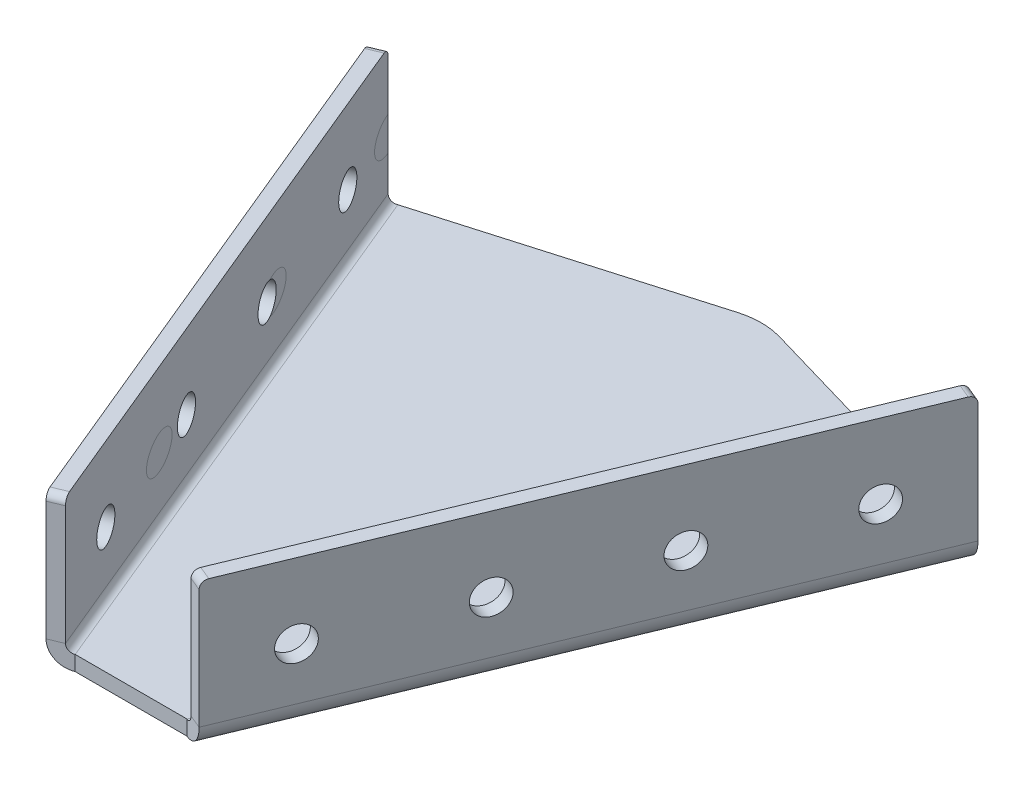
ISO-10303-21;
HEADER;
FILE_DESCRIPTION(('STEP AP214'),'2;1');
FILE_NAME('part.step','',(''),(''),'','','');
FILE_SCHEMA(('AUTOMOTIVE_DESIGN { 1 0 10303 214 1 1 1 1 }'));
ENDSEC;
DATA;
#1=APPLICATION_CONTEXT('core data for automotive mechanical design processes');
#2=APPLICATION_PROTOCOL_DEFINITION('international standard','automotive_design',2000,#1);
#3=PRODUCT_CONTEXT('',#1,'mechanical');
#4=PRODUCT('Part','Part','',(#3));
#5=PRODUCT_RELATED_PRODUCT_CATEGORY('part','',(#4));
#6=PRODUCT_DEFINITION_FORMATION('','',#4);
#7=PRODUCT_DEFINITION_CONTEXT('part definition',#1,'design');
#8=PRODUCT_DEFINITION('design','',#6,#7);
#9=PRODUCT_DEFINITION_SHAPE('','',#8);
#10=(LENGTH_UNIT() NAMED_UNIT(*) SI_UNIT(.MILLI.,.METRE.));
#11=(NAMED_UNIT(*) PLANE_ANGLE_UNIT() SI_UNIT($,.RADIAN.));
#12=(NAMED_UNIT(*) SI_UNIT($,.STERADIAN.) SOLID_ANGLE_UNIT());
#13=UNCERTAINTY_MEASURE_WITH_UNIT(LENGTH_MEASURE(1.E-05),#10,'distance_accuracy_value','');
#14=(GEOMETRIC_REPRESENTATION_CONTEXT(3) GLOBAL_UNCERTAINTY_ASSIGNED_CONTEXT((#13)) GLOBAL_UNIT_ASSIGNED_CONTEXT((#10,
#11,#12)) REPRESENTATION_CONTEXT('',''));
#15=CARTESIAN_POINT('',(0.,0.,0.));
#16=DIRECTION('',(0.,0.,1.));
#17=DIRECTION('',(1.,0.,0.));
#18=AXIS2_PLACEMENT_3D('',#15,#16,#17);
#19=CARTESIAN_POINT('',(-14.6510599239217,0.,6.06866772362923));
#20=DIRECTION('',(0.923879532511288,0.,-0.382683432365087));
#21=DIRECTION('',(-0.382683432365087,0.,-0.923879532511288));
#22=AXIS2_PLACEMENT_3D('',#19,#20,#21);
#23=PLANE('',#22);
#24=CARTESIAN_POINT('',(-34.6502513682729,32.9999999999987,-42.2136514978195));
#25=DIRECTION('',(0.923879532511288,0.,-0.382683432365087));
#26=DIRECTION('',(0.382683432365087,0.,0.923879532511288));
#27=AXIS2_PLACEMENT_3D('',#24,#25,#26);
#28=ELLIPSE('',#27,6.36396103067892,4.50000000000002);
#29=CARTESIAN_POINT('',(-32.214868917615,32.9999999999986,-36.3341181558758));
#30=VERTEX_POINT('',#29);
#31=EDGE_CURVE('E305',#30,#30,#28,.F.);
#32=ORIENTED_EDGE('',*,*,#31,.F.);
#33=EDGE_LOOP('',(#32));
#34=FACE_BOUND('',#33,.T.);
#35=ADVANCED_FACE('F16',(#34),#23,.T.);
#36=CARTESIAN_POINT('',(-56.2980953741205,32.9999999999988,-94.4761700928743));
#37=DIRECTION('',(0.923879532511288,0.,-0.382683432365087));
#38=DIRECTION('',(0.382683432365087,0.,0.923879532511288));
#39=AXIS2_PLACEMENT_3D('',#36,#37,#38);
#40=ELLIPSE('',#39,6.3639610306789,4.50000000000001);
#41=CARTESIAN_POINT('',(-55.6056998628285,37.3143002450352,-92.8045794589869));
#42=VERTEX_POINT('',#41);
#43=CARTESIAN_POINT('',(-55.6056998628291,28.685699754962,-92.8045794589884));
#44=VERTEX_POINT('',#43);
#45=EDGE_CURVE('E303',#42,#44,#40,.F.);
#46=ORIENTED_EDGE('',*,*,#45,.F.);
#47=CARTESIAN_POINT('',(-55.1161023015313,32.9999999999984,-91.6225863863985));
#48=DIRECTION('',(0.923879532511288,0.,-0.382683432365087));
#49=DIRECTION('',(-0.382683432365087,0.,-0.923879532511288));
#50=AXIS2_PLACEMENT_3D('',#47,#48,#49);
#51=CIRCLE('',#50,4.5);
#52=EDGE_CURVE('E795',#42,#44,#51,.F.);
#53=ORIENTED_EDGE('',*,*,#52,.T.);
#54=EDGE_LOOP('',(#46,#53));
#55=FACE_BOUND('',#54,.T.);
#56=ADVANCED_FACE('F426',(#55),#23,.T.);
#57=CARTESIAN_POINT('',(-77.9459393799681,32.9999999999989,-146.738688687929));
#58=DIRECTION('',(0.923879532511288,0.,-0.382683432365087));
#59=DIRECTION('',(0.382683432365087,0.,0.923879532511288));
#60=AXIS2_PLACEMENT_3D('',#57,#58,#59);
#61=ELLIPSE('',#60,6.36396103067889,4.5);
#62=CARTESIAN_POINT('',(-78.0771082434366,28.5065316812853,-147.055358337076));
#63=VERTEX_POINT('',#62);
#64=CARTESIAN_POINT('',(-78.0771082434366,37.4934683187125,-147.055358337076));
#65=VERTEX_POINT('',#64);
#66=EDGE_CURVE('E286',#63,#65,#61,.F.);
#67=ORIENTED_EDGE('',*,*,#66,.F.);
#68=DIRECTION('',(0.,1.,0.));
#69=VECTOR('',#68,1.);
#70=CARTESIAN_POINT('',(-78.0771082434366,17.,-147.055358337076));
#71=LINE('',#70,#69);
#72=EDGE_CURVE('E226',#65,#63,#71,.F.);
#73=ORIENTED_EDGE('',*,*,#72,.F.);
#74=EDGE_LOOP('',(#67,#73));
#75=FACE_BOUND('',#74,.T.);
#76=ADVANCED_FACE('F432',(#75),#23,.T.);
#77=CARTESIAN_POINT('',(76.229349178414,17.,-147.820725201806));
#78=DIRECTION('',(-0.279369770133786,0.,0.960183592619347));
#79=DIRECTION('',(-0.960183592619347,0.,-0.279369770133786));
#80=AXIS2_PLACEMENT_3D('',#77,#78,#79);
#81=PLANE('',#80);
#82=DIRECTION('',(-0.960183592619347,0.,-0.279369770133786));
#83=VECTOR('',#82,1.);
#84=CARTESIAN_POINT('',(76.229349178414,13.,-147.820725201806));
#85=LINE('',#84,#83);
#86=CARTESIAN_POINT('',(76.2293491784141,13.0000000000001,-147.820725201806));
#87=VERTEX_POINT('',#86);
#88=CARTESIAN_POINT('',(5.58739540267575,13.,-168.374321972078));
#89=VERTEX_POINT('',#88);
#90=EDGE_CURVE('E273',#87,#89,#85,.T.);
#91=ORIENTED_EDGE('',*,*,#90,.T.);
#92=DIRECTION('',(0.,-1.,0.));
#93=VECTOR('',#92,1.);
#94=CARTESIAN_POINT('',(5.58739540267575,17.,-168.374321972078));
#95=LINE('',#94,#93);
#96=CARTESIAN_POINT('',(5.58739540267575,17.,-168.374321972078));
#97=VERTEX_POINT('',#96);
#98=EDGE_CURVE('E308',#89,#97,#95,.F.);
#99=ORIENTED_EDGE('',*,*,#98,.T.);
#100=DIRECTION('',(-0.960183592619347,0.,-0.279369770133786));
#101=VECTOR('',#100,1.);
#102=CARTESIAN_POINT('',(76.229349178414,17.,-147.820725201806));
#103=LINE('',#102,#101);
#104=CARTESIAN_POINT('',(76.229349178414,17.,-147.820725201806));
#105=VERTEX_POINT('',#104);
#106=EDGE_CURVE('E263',#105,#97,#103,.T.);
#107=ORIENTED_EDGE('',*,*,#106,.F.);
#108=DIRECTION('',(0.,1.,0.));
#109=VECTOR('',#108,1.);
#110=CARTESIAN_POINT('',(76.229349178414,17.,-147.820725201806));
#111=LINE('',#110,#109);
#112=EDGE_CURVE('E282',#87,#105,#111,.T.);
#113=ORIENTED_EDGE('',*,*,#112,.F.);
#114=EDGE_LOOP('',(#91,#99,#107,#113));
#115=FACE_BOUND('',#114,.T.);
#116=ADVANCED_FACE('F447',(#115),#81,.F.);
#117=CARTESIAN_POINT('',(0.,17.,-170.));
#118=DIRECTION('',(0.279369770133786,0.,0.960183592619347));
#119=DIRECTION('',(-0.960183592619347,0.,0.279369770133786));
#120=AXIS2_PLACEMENT_3D('',#117,#118,#119);
#121=PLANE('',#120);
#122=DIRECTION('',(-0.960183592619347,0.,0.279369770133786));
#123=VECTOR('',#122,1.);
#124=CARTESIAN_POINT('',(0.,17.,-170.));
#125=LINE('',#124,#123);
#126=CARTESIAN_POINT('',(-5.5873954026757,17.,-168.374321972078));
#127=VERTEX_POINT('',#126);
#128=CARTESIAN_POINT('',(-76.229349178414,17.,-147.820725201806));
#129=VERTEX_POINT('',#128);
#130=EDGE_CURVE('E266',#127,#129,#125,.T.);
#131=ORIENTED_EDGE('',*,*,#130,.F.);
#132=DIRECTION('',(0.,-1.,0.));
#133=VECTOR('',#132,1.);
#134=CARTESIAN_POINT('',(-5.5873954026757,17.,-168.374321972078));
#135=LINE('',#134,#133);
#136=CARTESIAN_POINT('',(-5.5873954026757,13.,-168.374321972078));
#137=VERTEX_POINT('',#136);
#138=EDGE_CURVE('E313',#127,#137,#135,.T.);
#139=ORIENTED_EDGE('',*,*,#138,.T.);
#140=DIRECTION('',(-0.960183592619347,0.,0.279369770133786));
#141=VECTOR('',#140,1.);
#142=CARTESIAN_POINT('',(0.,13.,-170.));
#143=LINE('',#142,#141);
#144=CARTESIAN_POINT('',(-76.229349178414,13.,-147.820725201806));
#145=VERTEX_POINT('',#144);
#146=EDGE_CURVE('E258',#137,#145,#143,.T.);
#147=ORIENTED_EDGE('',*,*,#146,.T.);
#148=DIRECTION('',(0.,1.,0.));
#149=VECTOR('',#148,1.);
#150=CARTESIAN_POINT('',(-76.229349178414,17.,-147.820725201806));
#151=LINE('',#150,#149);
#152=EDGE_CURVE('E279',#145,#129,#151,.T.);
#153=ORIENTED_EDGE('',*,*,#152,.T.);
#154=EDGE_LOOP('',(#131,#139,#147,#153));
#155=FACE_BOUND('',#154,.T.);
#156=ADVANCED_FACE('F452',(#155),#121,.F.);
#157=CARTESIAN_POINT('',(-15.,17.,0.));
#158=DIRECTION('',(0.,0.,-1.));
#159=DIRECTION('',(1.,0.,0.));
#160=AXIS2_PLACEMENT_3D('',#157,#158,#159);
#161=PLANE('',#160);
#162=DIRECTION('',(1.,0.,0.));
#163=VECTOR('',#162,1.);
#164=CARTESIAN_POINT('',(0.,13.,0.));
#165=LINE('',#164,#163);
#166=CARTESIAN_POINT('',(-14.9999999999999,13.,0.));
#167=VERTEX_POINT('',#166);
#168=CARTESIAN_POINT('',(15.,13.,0.));
#169=VERTEX_POINT('',#168);
#170=EDGE_CURVE('E271',#167,#169,#165,.T.);
#171=ORIENTED_EDGE('',*,*,#170,.T.);
#172=DIRECTION('',(0.,1.,0.));
#173=VECTOR('',#172,1.);
#174=CARTESIAN_POINT('',(15.,17.,0.));
#175=LINE('',#174,#173);
#176=CARTESIAN_POINT('',(15.,17.,0.));
#177=VERTEX_POINT('',#176);
#178=EDGE_CURVE('E284',#169,#177,#175,.T.);
#179=ORIENTED_EDGE('',*,*,#178,.T.);
#180=DIRECTION('',(1.,0.,0.));
#181=VECTOR('',#180,1.);
#182=CARTESIAN_POINT('',(-15.,17.,0.));
#183=LINE('',#182,#181);
#184=CARTESIAN_POINT('',(-15.,17.,0.));
#185=VERTEX_POINT('',#184);
#186=EDGE_CURVE('E257',#185,#177,#183,.T.);
#187=ORIENTED_EDGE('',*,*,#186,.F.);
#188=DIRECTION('',(0.,1.,0.));
#189=VECTOR('',#188,1.);
#190=CARTESIAN_POINT('',(-15.,17.,0.));
#191=LINE('',#190,#189);
#192=EDGE_CURVE('E268',#167,#185,#191,.T.);
#193=ORIENTED_EDGE('',*,*,#192,.F.);
#194=EDGE_LOOP('',(#171,#179,#187,#193));
#195=FACE_BOUND('',#194,.T.);
#196=ADVANCED_FACE('F389',(#195),#161,.F.);
#197=CARTESIAN_POINT('',(0.,17.,0.));
#198=DIRECTION('',(0.,-1.,0.));
#199=DIRECTION('',(0.,0.,-1.));
#200=AXIS2_PLACEMENT_3D('',#197,#198,#199);
#201=PLANE('',#200);
#202=ORIENTED_EDGE('',*,*,#106,.T.);
#203=CARTESIAN_POINT('',(0.,17.,-149.170650119691));
#204=DIRECTION('',(0.,-1.,0.));
#205=DIRECTION('',(0.,0.,-1.));
#206=AXIS2_PLACEMENT_3D('',#203,#204,#205);
#207=CIRCLE('',#206,20.);
#208=EDGE_CURVE('E311',#97,#127,#207,.F.);
#209=ORIENTED_EDGE('',*,*,#208,.T.);
#210=ORIENTED_EDGE('',*,*,#130,.T.);
#211=DIRECTION('',(0.382683432365087,0.,0.923879532511288));
#212=VECTOR('',#211,1.);
#213=CARTESIAN_POINT('',(-76.229349178414,17.,-147.820725201806));
#214=LINE('',#213,#212);
#215=EDGE_CURVE('E255',#129,#185,#214,.T.);
#216=ORIENTED_EDGE('',*,*,#215,.T.);
#217=ORIENTED_EDGE('',*,*,#186,.T.);
#218=DIRECTION('',(0.382683432365087,0.,-0.923879532511288));
#219=VECTOR('',#218,1.);
#220=CARTESIAN_POINT('',(15.,17.,0.));
#221=LINE('',#220,#219);
#222=EDGE_CURVE('E261',#177,#105,#221,.T.);
#223=ORIENTED_EDGE('',*,*,#222,.T.);
#224=EDGE_LOOP('',(#202,#209,#210,#216,#217,#223));
#225=FACE_BOUND('',#224,.T.);
#226=ADVANCED_FACE('F384',(#225),#201,.F.);
#227=CARTESIAN_POINT('',(0.,13.,0.));
#228=DIRECTION('',(0.,-1.,0.));
#229=DIRECTION('',(0.,0.,-1.));
#230=AXIS2_PLACEMENT_3D('',#227,#228,#229);
#231=PLANE('',#230);
#232=ORIENTED_EDGE('',*,*,#146,.F.);
#233=CARTESIAN_POINT('',(0.,13.,-149.170650119691));
#234=DIRECTION('',(0.,-1.,0.));
#235=DIRECTION('',(0.,0.,-1.));
#236=AXIS2_PLACEMENT_3D('',#233,#234,#235);
#237=CIRCLE('',#236,20.);
#238=EDGE_CURVE('E315',#137,#89,#237,.T.);
#239=ORIENTED_EDGE('',*,*,#238,.T.);
#240=ORIENTED_EDGE('',*,*,#90,.F.);
#241=DIRECTION('',(0.382683432365087,0.,-0.923879532511288));
#242=VECTOR('',#241,1.);
#243=CARTESIAN_POINT('',(15.,13.,0.));
#244=LINE('',#243,#242);
#245=EDGE_CURVE('E164',#169,#87,#244,.T.);
#246=ORIENTED_EDGE('',*,*,#245,.F.);
#247=ORIENTED_EDGE('',*,*,#170,.F.);
#248=DIRECTION('',(0.382683432365087,0.,0.923879532511288));
#249=VECTOR('',#248,1.);
#250=CARTESIAN_POINT('',(-76.229349178414,13.,-147.820725201806));
#251=LINE('',#250,#249);
#252=EDGE_CURVE('E246',#145,#167,#251,.T.);
#253=ORIENTED_EDGE('',*,*,#252,.F.);
#254=EDGE_LOOP('',(#232,#239,#240,#246,#247,#253));
#255=FACE_BOUND('',#254,.T.);
#256=ADVANCED_FACE('F719',(#255),#231,.T.);
#257=CARTESIAN_POINT('',(-76.229349178414,19.,-147.820725201806));
#258=DIRECTION('',(-0.382683432365087,0.,-0.923879532511288));
#259=DIRECTION('',(-0.923879532511288,0.,0.382683432365087));
#260=AXIS2_PLACEMENT_3D('',#257,#258,#259);
#261=PLANE('',#260);
#262=DIRECTION('',(0.923879532511288,0.,-0.382683432365087));
#263=VECTOR('',#262,1.);
#264=CARTESIAN_POINT('',(-81.7726263734817,19.,-145.524624607616));
#265=LINE('',#264,#263);
#266=CARTESIAN_POINT('',(-78.0771082434366,19.,-147.055358337076));
#267=VERTEX_POINT('',#266);
#268=CARTESIAN_POINT('',(-81.7726263734817,19.,-145.524624607616));
#269=VERTEX_POINT('',#268);
#270=EDGE_CURVE('E212',#267,#269,#265,.F.);
#271=ORIENTED_EDGE('',*,*,#270,.F.);
#272=CARTESIAN_POINT('',(-76.229349178414,19.,-147.820725201806));
#273=DIRECTION('',(0.382683432365087,0.,0.923879532511288));
#274=DIRECTION('',(0.923879532511288,0.,-0.382683432365087));
#275=AXIS2_PLACEMENT_3D('',#272,#273,#274);
#276=CIRCLE('',#275,2.00000000000004);
#277=EDGE_CURVE('E250',#129,#267,#276,.F.);
#278=ORIENTED_EDGE('',*,*,#277,.F.);
#279=ORIENTED_EDGE('',*,*,#152,.F.);
#280=CARTESIAN_POINT('',(-76.229349178414,19.,-147.820725201806));
#281=DIRECTION('',(0.382683432365087,0.,0.923879532511288));
#282=DIRECTION('',(0.923879532511288,0.,-0.382683432365087));
#283=AXIS2_PLACEMENT_3D('',#280,#281,#282);
#284=CIRCLE('',#283,6.00000000000004);
#285=EDGE_CURVE('E243',#145,#269,#284,.F.);
#286=ORIENTED_EDGE('',*,*,#285,.T.);
#287=EDGE_LOOP('',(#271,#278,#279,#286));
#288=FACE_BOUND('',#287,.T.);
#289=ADVANCED_FACE('F370',(#288),#261,.T.);
#290=CARTESIAN_POINT('',(-15.,19.,0.));
#291=DIRECTION('',(-0.382683432365087,0.,-0.923879532511288));
#292=DIRECTION('',(-0.923879532511288,0.,0.382683432365087));
#293=AXIS2_PLACEMENT_3D('',#290,#291,#292);
#294=PLANE('',#293);
#295=CARTESIAN_POINT('',(-15.,19.,0.));
#296=DIRECTION('',(0.382683432365087,0.,0.923879532511288));
#297=DIRECTION('',(0.923879532511288,0.,-0.382683432365087));
#298=AXIS2_PLACEMENT_3D('',#295,#296,#297);
#299=CIRCLE('',#298,2.00000000000004);
#300=CARTESIAN_POINT('',(-16.8477590650226,19.,0.765366864730219));
#301=VERTEX_POINT('',#300);
#302=EDGE_CURVE('E219',#301,#185,#299,.T.);
#303=ORIENTED_EDGE('',*,*,#302,.F.);
#304=DIRECTION('',(0.923879532511288,0.,-0.382683432365087));
#305=VECTOR('',#304,1.);
#306=CARTESIAN_POINT('',(-16.8477590650226,19.,0.765366864730194));
#307=LINE('',#306,#305);
#308=CARTESIAN_POINT('',(-20.5432771950677,19.,2.29610059419054));
#309=VERTEX_POINT('',#308);
#310=EDGE_CURVE('E236',#301,#309,#307,.F.);
#311=ORIENTED_EDGE('',*,*,#310,.T.);
#312=CARTESIAN_POINT('',(-15.,19.,0.));
#313=DIRECTION('',(0.382683432365087,0.,0.923879532511288));
#314=DIRECTION('',(0.923879532511288,0.,-0.382683432365087));
#315=AXIS2_PLACEMENT_3D('',#312,#313,#314);
#316=CIRCLE('',#315,6.00000000000004);
#317=EDGE_CURVE('E247',#309,#167,#316,.T.);
#318=ORIENTED_EDGE('',*,*,#317,.T.);
#319=ORIENTED_EDGE('',*,*,#192,.T.);
#320=EDGE_LOOP('',(#303,#311,#318,#319));
#321=FACE_BOUND('',#320,.T.);
#322=ADVANCED_FACE('F363',(#321),#294,.F.);
#323=CARTESIAN_POINT('',(-15.,19.,0.));
#324=DIRECTION('',(0.382683432365087,0.,0.923879532511288));
#325=DIRECTION('',(-0.923879532511288,0.,0.382683432365087));
#326=AXIS2_PLACEMENT_3D('',#323,#324,#325);
#327=CYLINDRICAL_SURFACE('',#326,6.00000000000004);
#328=ORIENTED_EDGE('',*,*,#252,.T.);
#329=ORIENTED_EDGE('',*,*,#317,.F.);
#330=DIRECTION('',(0.382683432365087,0.,0.923879532511288));
#331=VECTOR('',#330,1.);
#332=CARTESIAN_POINT('',(-81.7726263734817,19.,-145.524624607616));
#333=LINE('',#332,#331);
#334=EDGE_CURVE('E233',#309,#269,#333,.F.);
#335=ORIENTED_EDGE('',*,*,#334,.T.);
#336=ORIENTED_EDGE('',*,*,#285,.F.);
#337=EDGE_LOOP('',(#328,#329,#335,#336));
#338=FACE_BOUND('',#337,.T.);
#339=ADVANCED_FACE('F366',(#338),#327,.T.);
#340=CARTESIAN_POINT('',(-15.,19.,0.));
#341=DIRECTION('',(0.382683432365087,0.,0.923879532511288));
#342=DIRECTION('',(-0.923879532511288,0.,0.382683432365087));
#343=AXIS2_PLACEMENT_3D('',#340,#341,#342);
#344=CYLINDRICAL_SURFACE('',#343,2.00000000000004);
#345=ORIENTED_EDGE('',*,*,#215,.F.);
#346=ORIENTED_EDGE('',*,*,#277,.T.);
#347=DIRECTION('',(0.382683432365087,0.,0.923879532511288));
#348=VECTOR('',#347,1.);
#349=CARTESIAN_POINT('',(-78.0771082434366,19.,-147.055358337076));
#350=LINE('',#349,#348);
#351=EDGE_CURVE('E239',#267,#301,#350,.T.);
#352=ORIENTED_EDGE('',*,*,#351,.T.);
#353=ORIENTED_EDGE('',*,*,#302,.T.);
#354=EDGE_LOOP('',(#345,#346,#352,#353));
#355=FACE_BOUND('',#354,.T.);
#356=ADVANCED_FACE('F381',(#355),#344,.F.);
#357=CARTESIAN_POINT('',(-20.5432771950678,52.9999999999968,2.29610059419056));
#358=DIRECTION('',(-0.382683432365087,0.,-0.923879532511288));
#359=DIRECTION('',(-0.923879532511288,0.,0.382683432365087));
#360=AXIS2_PLACEMENT_3D('',#357,#358,#359);
#361=PLANE('',#360);
#362=DIRECTION('',(0.,-1.,0.));
#363=VECTOR('',#362,1.);
#364=CARTESIAN_POINT('',(-16.8477590650227,52.9999999999968,0.765366864730218));
#365=LINE('',#364,#363);
#366=CARTESIAN_POINT('',(-16.8477590650227,50.9999999999968,0.765366864730215));
#367=VERTEX_POINT('',#366);
#368=EDGE_CURVE('E231',#301,#367,#365,.F.);
#369=ORIENTED_EDGE('',*,*,#368,.T.);
#370=DIRECTION('',(0.923879532511288,0.,-0.382683432365087));
#371=VECTOR('',#370,1.);
#372=CARTESIAN_POINT('',(-20.5432771950678,50.9999999999968,2.29610059419056));
#373=LINE('',#372,#371);
#374=CARTESIAN_POINT('',(-20.5432771950678,50.9999999999968,2.29610059419056));
#375=VERTEX_POINT('',#374);
#376=EDGE_CURVE('E39',#367,#375,#373,.F.);
#377=ORIENTED_EDGE('',*,*,#376,.T.);
#378=DIRECTION('',(0.,1.,0.));
#379=VECTOR('',#378,1.);
#380=CARTESIAN_POINT('',(-20.5432771950677,0.,2.2961005941905));
#381=LINE('',#380,#379);
#382=EDGE_CURVE('E222',#309,#375,#381,.T.);
#383=ORIENTED_EDGE('',*,*,#382,.F.);
#384=ORIENTED_EDGE('',*,*,#310,.F.);
#385=EDGE_LOOP('',(#369,#377,#383,#384));
#386=FACE_BOUND('',#385,.T.);
#387=ADVANCED_FACE('F360',(#386),#361,.F.);
#388=CARTESIAN_POINT('',(-81.7726263734817,17.,-145.524624607616));
#389=DIRECTION('',(0.382683432365087,0.,0.923879532511288));
#390=DIRECTION('',(0.923879532511288,0.,-0.382683432365087));
#391=AXIS2_PLACEMENT_3D('',#388,#389,#390);
#392=PLANE('',#391);
#393=DIRECTION('',(0.,-1.,0.));
#394=VECTOR('',#393,1.);
#395=CARTESIAN_POINT('',(-81.7726263734816,0.,-145.524624607616));
#396=LINE('',#395,#394);
#397=CARTESIAN_POINT('',(-81.7726263734818,50.9999999999968,-145.524624607615));
#398=VERTEX_POINT('',#397);
#399=EDGE_CURVE('E217',#398,#269,#396,.T.);
#400=ORIENTED_EDGE('',*,*,#399,.F.);
#401=DIRECTION('',(0.923879532511288,0.,-0.382683432365087));
#402=VECTOR('',#401,1.);
#403=CARTESIAN_POINT('',(-81.7726263734818,50.9999999999968,-145.524624607615));
#404=LINE('',#403,#402);
#405=CARTESIAN_POINT('',(-78.0771082434367,50.9999999999968,-147.055358337076));
#406=VERTEX_POINT('',#405);
#407=EDGE_CURVE('E10',#398,#406,#404,.T.);
#408=ORIENTED_EDGE('',*,*,#407,.T.);
#409=EDGE_CURVE('E224',#406,#65,#71,.F.);
#410=ORIENTED_EDGE('',*,*,#409,.T.);
#411=ORIENTED_EDGE('',*,*,#72,.T.);
#412=EDGE_CURVE('E227',#63,#267,#71,.F.);
#413=ORIENTED_EDGE('',*,*,#412,.T.);
#414=ORIENTED_EDGE('',*,*,#270,.T.);
#415=EDGE_LOOP('',(#400,#408,#410,#411,#413,#414));
#416=FACE_BOUND('',#415,.T.);
#417=ADVANCED_FACE('F373',(#416),#392,.F.);
#418=CARTESIAN_POINT('',(-18.3465780539668,0.,7.59940145308958));
#419=DIRECTION('',(0.923879532511288,0.,-0.382683432365087));
#420=DIRECTION('',(-0.382683432365087,0.,-0.923879532511288));
#421=AXIS2_PLACEMENT_3D('',#418,#419,#420);
#422=PLANE('',#421);
#423=CARTESIAN_POINT('',(-58.8116204315765,32.9999999999983,-90.0918526569381));
#424=DIRECTION('',(-0.923879532511288,0.,0.382683432365087));
#425=DIRECTION('',(0.382683432365087,0.,0.923879532511288));
#426=AXIS2_PLACEMENT_3D('',#423,#424,#425);
#427=CIRCLE('',#426,4.5);
#428=CARTESIAN_POINT('',(-57.0895449859336,32.9999999999983,-85.9343947606373));
#429=VERTEX_POINT('',#428);
#430=EDGE_CURVE('E792',#429,#429,#427,.T.);
#431=ORIENTED_EDGE('',*,*,#430,.F.);
#432=EDGE_LOOP('',(#431));
#433=FACE_BOUND('',#432,.T.);
#434=CARTESIAN_POINT('',(-43.504283136973,32.9999999999984,-53.1366713564866));
#435=DIRECTION('',(-0.923879532511288,0.,0.382683432365087));
#436=DIRECTION('',(0.382683432365087,0.,0.923879532511288));
#437=AXIS2_PLACEMENT_3D('',#434,#435,#436);
#438=CIRCLE('',#437,4.50000000000001);
#439=CARTESIAN_POINT('',(-41.7822076913301,32.9999999999984,-48.9792134601858));
#440=VERTEX_POINT('',#439);
#441=EDGE_CURVE('E801',#440,#440,#438,.T.);
#442=ORIENTED_EDGE('',*,*,#441,.F.);
#443=EDGE_LOOP('',(#442));
#444=FACE_BOUND('',#443,.T.);
#445=CARTESIAN_POINT('',(-28.1969458423695,32.9999999999985,-16.1814900560351));
#446=DIRECTION('',(-0.923879532511288,0.,0.382683432365087));
#447=DIRECTION('',(0.382683432365087,0.,0.923879532511288));
#448=AXIS2_PLACEMENT_3D('',#445,#446,#447);
#449=CIRCLE('',#448,4.50000000000002);
#450=CARTESIAN_POINT('',(-26.4748703967266,32.9999999999985,-12.0240321597343));
#451=VERTEX_POINT('',#450);
#452=EDGE_CURVE('E292',#451,#451,#449,.T.);
#453=ORIENTED_EDGE('',*,*,#452,.F.);
#454=EDGE_LOOP('',(#453));
#455=FACE_BOUND('',#454,.T.);
#456=CARTESIAN_POINT('',(-74.1189577261799,32.9999999999983,-127.04703395739));
#457=DIRECTION('',(-0.923879532511288,0.,0.382683432365087));
#458=DIRECTION('',(0.382683432365087,0.,0.923879532511288));
#459=AXIS2_PLACEMENT_3D('',#456,#457,#458);
#460=CIRCLE('',#459,4.49999999999999);
#461=CARTESIAN_POINT('',(-72.396882280537,32.9999999999983,-122.889576061089));
#462=VERTEX_POINT('',#461);
#463=EDGE_CURVE('E800',#462,#462,#460,.T.);
#464=ORIENTED_EDGE('',*,*,#463,.F.);
#465=EDGE_LOOP('',(#464));
#466=FACE_BOUND('',#465,.T.);
#467=ORIENTED_EDGE('',*,*,#382,.T.);
#468=CARTESIAN_POINT('',(-21.308644059798,50.9999999999968,0.448341529168005));
#469=DIRECTION('',(0.923879532511288,0.,-0.382683432365087));
#470=DIRECTION('',(-0.382683432365087,0.,-0.923879532511288));
#471=AXIS2_PLACEMENT_3D('',#468,#469,#470);
#472=CIRCLE('',#471,2.);
#473=CARTESIAN_POINT('',(-21.308644059798,52.9999999999968,0.448341529168006));
#474=VERTEX_POINT('',#473);
#475=EDGE_CURVE('E24',#375,#474,#472,.F.);
#476=ORIENTED_EDGE('',*,*,#475,.T.);
#477=DIRECTION('',(-0.382683432365087,0.,-0.923879532511288));
#478=VECTOR('',#477,1.);
#479=CARTESIAN_POINT('',(-18.346578053967,52.9999999999968,7.59940145308965));
#480=LINE('',#479,#478);
#481=CARTESIAN_POINT('',(-81.0072595087516,52.9999999999968,-143.676865542593));
#482=VERTEX_POINT('',#481);
#483=EDGE_CURVE('E220',#474,#482,#480,.T.);
#484=ORIENTED_EDGE('',*,*,#483,.T.);
#485=CARTESIAN_POINT('',(-81.0072595087516,50.9999999999968,-143.676865542593));
#486=DIRECTION('',(0.923879532511288,0.,-0.382683432365087));
#487=DIRECTION('',(-0.382683432365087,0.,-0.923879532511288));
#488=AXIS2_PLACEMENT_3D('',#485,#486,#487);
#489=CIRCLE('',#488,2.);
#490=EDGE_CURVE('E31',#482,#398,#489,.F.);
#491=ORIENTED_EDGE('',*,*,#490,.T.);
#492=ORIENTED_EDGE('',*,*,#399,.T.);
#493=ORIENTED_EDGE('',*,*,#334,.F.);
#494=EDGE_LOOP('',(#467,#476,#484,#491,#492,#493));
#495=FACE_BOUND('',#494,.T.);
#496=ADVANCED_FACE('F346',(#433,#444,#455,#466,#495),#422,.F.);
#497=ORIENTED_EDGE('',*,*,#31,.T.);
#498=EDGE_LOOP('',(#497));
#499=FACE_BOUND('',#498,.T.);
#500=EDGE_CURVE('E797',#44,#42,#51,.F.);
#501=ORIENTED_EDGE('',*,*,#500,.T.);
#502=ORIENTED_EDGE('',*,*,#45,.T.);
#503=EDGE_LOOP('',(#501,#502));
#504=FACE_BOUND('',#503,.T.);
#505=CARTESIAN_POINT('',(-39.8087650069278,32.9999999999984,-54.6674050859469));
#506=DIRECTION('',(0.923879532511288,0.,-0.382683432365087));
#507=DIRECTION('',(-0.382683432365087,0.,-0.923879532511288));
#508=AXIS2_PLACEMENT_3D('',#505,#506,#507);
#509=CIRCLE('',#508,4.50000000000001);
#510=CARTESIAN_POINT('',(-41.5308404525707,32.9999999999984,-58.8248629822477));
#511=VERTEX_POINT('',#510);
#512=EDGE_CURVE('E796',#511,#511,#509,.F.);
#513=ORIENTED_EDGE('',*,*,#512,.T.);
#514=EDGE_LOOP('',(#513));
#515=FACE_BOUND('',#514,.T.);
#516=CARTESIAN_POINT('',(-24.5014277123243,32.9999999999985,-17.7122237854955));
#517=DIRECTION('',(0.923879532511288,0.,-0.382683432365087));
#518=DIRECTION('',(-0.382683432365087,0.,-0.923879532511288));
#519=AXIS2_PLACEMENT_3D('',#516,#517,#518);
#520=CIRCLE('',#519,4.50000000000002);
#521=CARTESIAN_POINT('',(-26.2235031579672,32.9999999999985,-21.8696816817963));
#522=VERTEX_POINT('',#521);
#523=EDGE_CURVE('E804',#522,#522,#520,.F.);
#524=ORIENTED_EDGE('',*,*,#523,.T.);
#525=EDGE_LOOP('',(#524));
#526=FACE_BOUND('',#525,.T.);
#527=CARTESIAN_POINT('',(-70.4234395961348,32.9999999999983,-128.57776768685));
#528=DIRECTION('',(0.923879532511288,0.,-0.382683432365087));
#529=DIRECTION('',(-0.382683432365087,0.,-0.923879532511288));
#530=AXIS2_PLACEMENT_3D('',#527,#528,#529);
#531=CIRCLE('',#530,4.49999999999999);
#532=CARTESIAN_POINT('',(-72.1455150417777,32.9999999999983,-132.735225583151));
#533=VERTEX_POINT('',#532);
#534=EDGE_CURVE('E211',#533,#533,#531,.F.);
#535=ORIENTED_EDGE('',*,*,#534,.T.);
#536=EDGE_LOOP('',(#535));
#537=FACE_BOUND('',#536,.T.);
#538=DIRECTION('',(0.382683432365087,0.,0.923879532511288));
#539=VECTOR('',#538,1.);
#540=CARTESIAN_POINT('',(-78.0771082434367,52.9999999999968,-147.055358337076));
#541=LINE('',#540,#539);
#542=CARTESIAN_POINT('',(-17.6131259297529,52.9999999999968,-1.0823922002923));
#543=VERTEX_POINT('',#542);
#544=CARTESIAN_POINT('',(-77.3117413787065,52.9999999999968,-145.207599272053));
#545=VERTEX_POINT('',#544);
#546=EDGE_CURVE('E228',#543,#545,#541,.F.);
#547=ORIENTED_EDGE('',*,*,#546,.F.);
#548=CARTESIAN_POINT('',(-17.6131259297529,50.9999999999968,-1.08239220029234));
#549=DIRECTION('',(0.923879532511288,0.,-0.382683432365087));
#550=DIRECTION('',(-0.382683432365087,0.,-0.923879532511288));
#551=AXIS2_PLACEMENT_3D('',#548,#549,#550);
#552=CIRCLE('',#551,2.);
#553=EDGE_CURVE('E341',#543,#367,#552,.T.);
#554=ORIENTED_EDGE('',*,*,#553,.T.);
#555=ORIENTED_EDGE('',*,*,#368,.F.);
#556=ORIENTED_EDGE('',*,*,#351,.F.);
#557=ORIENTED_EDGE('',*,*,#412,.F.);
#558=ORIENTED_EDGE('',*,*,#66,.T.);
#559=ORIENTED_EDGE('',*,*,#409,.F.);
#560=CARTESIAN_POINT('',(-77.3117413787065,50.9999999999968,-145.207599272053));
#561=DIRECTION('',(0.923879532511288,0.,-0.382683432365087));
#562=DIRECTION('',(-0.382683432365087,0.,-0.923879532511288));
#563=AXIS2_PLACEMENT_3D('',#560,#561,#562);
#564=CIRCLE('',#563,2.);
#565=EDGE_CURVE('E339',#406,#545,#564,.T.);
#566=ORIENTED_EDGE('',*,*,#565,.T.);
#567=EDGE_LOOP('',(#547,#554,#555,#556,#557,#558,#559,#566));
#568=FACE_BOUND('',#567,.T.);
#569=ADVANCED_FACE('F357',(#499,#504,#515,#526,#537,#568),#23,.T.);
#570=CARTESIAN_POINT('',(-81.7726263734818,52.9999999999968,-145.524624607615));
#571=DIRECTION('',(0.,-1.,0.));
#572=DIRECTION('',(1.,0.,0.));
#573=AXIS2_PLACEMENT_3D('',#570,#571,#572);
#574=PLANE('',#573);
#575=ORIENTED_EDGE('',*,*,#483,.F.);
#576=DIRECTION('',(0.923879532511288,0.,-0.382683432365087));
#577=VECTOR('',#576,1.);
#578=CARTESIAN_POINT('',(-21.308644059798,52.9999999999968,0.448341529168034));
#579=LINE('',#578,#577);
#580=EDGE_CURVE('E336',#474,#543,#579,.T.);
#581=ORIENTED_EDGE('',*,*,#580,.T.);
#582=ORIENTED_EDGE('',*,*,#546,.T.);
#583=DIRECTION('',(0.923879532511288,0.,-0.382683432365087));
#584=VECTOR('',#583,1.);
#585=CARTESIAN_POINT('',(-81.0072595087516,52.9999999999968,-143.676865542593));
#586=LINE('',#585,#584);
#587=EDGE_CURVE('E334',#545,#482,#586,.F.);
#588=ORIENTED_EDGE('',*,*,#587,.T.);
#589=EDGE_LOOP('',(#575,#581,#582,#588));
#590=FACE_BOUND('',#589,.T.);
#591=ADVANCED_FACE('F351',(#590),#574,.F.);
#592=CARTESIAN_POINT('',(15.0000000000001,19.,0.));
#593=DIRECTION('',(-0.382683432365087,0.,0.923879532511288));
#594=DIRECTION('',(0.923879532511288,0.,0.382683432365087));
#595=AXIS2_PLACEMENT_3D('',#592,#593,#594);
#596=PLANE('',#595);
#597=DIRECTION('',(-0.923879532511288,0.,-0.382683432365087));
#598=VECTOR('',#597,1.);
#599=CARTESIAN_POINT('',(20.5432771950677,19.,2.29610059419052));
#600=LINE('',#599,#598);
#601=CARTESIAN_POINT('',(16.8477590650226,19.,0.765366864730194));
#602=VERTEX_POINT('',#601);
#603=CARTESIAN_POINT('',(20.5432771950677,19.,2.29610059419058));
#604=VERTEX_POINT('',#603);
#605=EDGE_CURVE('E208',#602,#604,#600,.F.);
#606=ORIENTED_EDGE('',*,*,#605,.F.);
#607=CARTESIAN_POINT('',(15.0000000000001,19.,0.));
#608=DIRECTION('',(0.382683432365087,0.,-0.923879532511288));
#609=DIRECTION('',(-0.923879532511288,0.,-0.382683432365087));
#610=AXIS2_PLACEMENT_3D('',#607,#608,#609);
#611=CIRCLE('',#610,1.99999999999994);
#612=EDGE_CURVE('E168',#177,#602,#611,.F.);
#613=ORIENTED_EDGE('',*,*,#612,.F.);
#614=ORIENTED_EDGE('',*,*,#178,.F.);
#615=CARTESIAN_POINT('',(15.,19.,0.));
#616=DIRECTION('',(0.382683432365087,0.,-0.923879532511288));
#617=DIRECTION('',(-0.923879532511288,0.,-0.382683432365087));
#618=AXIS2_PLACEMENT_3D('',#615,#616,#617);
#619=CIRCLE('',#618,5.99999999999994);
#620=EDGE_CURVE('E167',#169,#604,#619,.F.);
#621=ORIENTED_EDGE('',*,*,#620,.T.);
#622=EDGE_LOOP('',(#606,#613,#614,#621));
#623=FACE_BOUND('',#622,.T.);
#624=ADVANCED_FACE('F394',(#623),#596,.T.);
#625=CARTESIAN_POINT('',(76.2293491784139,19.,-147.820725201806));
#626=DIRECTION('',(-0.382683432365087,0.,0.923879532511288));
#627=DIRECTION('',(0.923879532511288,0.,0.382683432365087));
#628=AXIS2_PLACEMENT_3D('',#625,#626,#627);
#629=PLANE('',#628);
#630=CARTESIAN_POINT('',(76.2293491784139,19.,-147.820725201806));
#631=DIRECTION('',(0.382683432365087,0.,-0.923879532511288));
#632=DIRECTION('',(-0.923879532511288,0.,-0.382683432365087));
#633=AXIS2_PLACEMENT_3D('',#630,#631,#632);
#634=CIRCLE('',#633,1.99999999999994);
#635=CARTESIAN_POINT('',(78.0771082434364,19.,-147.055358337076));
#636=VERTEX_POINT('',#635);
#637=EDGE_CURVE('E175',#636,#105,#634,.T.);
#638=ORIENTED_EDGE('',*,*,#637,.F.);
#639=DIRECTION('',(-0.923879532511288,0.,-0.382683432365087));
#640=VECTOR('',#639,1.);
#641=CARTESIAN_POINT('',(78.0771082434366,19.,-147.055358337076));
#642=LINE('',#641,#640);
#643=CARTESIAN_POINT('',(81.7726263734817,19.,-145.524624607616));
#644=VERTEX_POINT('',#643);
#645=EDGE_CURVE('E172',#636,#644,#642,.F.);
#646=ORIENTED_EDGE('',*,*,#645,.T.);
#647=CARTESIAN_POINT('',(76.2293491784139,19.,-147.820725201806));
#648=DIRECTION('',(0.382683432365087,0.,-0.923879532511288));
#649=DIRECTION('',(-0.923879532511288,0.,-0.382683432365087));
#650=AXIS2_PLACEMENT_3D('',#647,#648,#649);
#651=CIRCLE('',#650,5.99999999999994);
#652=EDGE_CURVE('E157',#644,#87,#651,.T.);
#653=ORIENTED_EDGE('',*,*,#652,.T.);
#654=ORIENTED_EDGE('',*,*,#112,.T.);
#655=EDGE_LOOP('',(#638,#646,#653,#654));
#656=FACE_BOUND('',#655,.T.);
#657=ADVANCED_FACE('F173',(#656),#629,.F.);
#658=CARTESIAN_POINT('',(76.2293491784139,19.,-147.820725201806));
#659=DIRECTION('',(0.382683432365087,0.,-0.923879532511288));
#660=DIRECTION('',(0.923879532511288,0.,0.382683432365087));
#661=AXIS2_PLACEMENT_3D('',#658,#659,#660);
#662=CYLINDRICAL_SURFACE('',#661,5.99999999999994);
#663=ORIENTED_EDGE('',*,*,#245,.T.);
#664=ORIENTED_EDGE('',*,*,#652,.F.);
#665=DIRECTION('',(0.382683432365087,0.,-0.923879532511288));
#666=VECTOR('',#665,1.);
#667=CARTESIAN_POINT('',(20.5432771950677,19.,2.29610059419053));
#668=LINE('',#667,#666);
#669=EDGE_CURVE('E162',#644,#604,#668,.F.);
#670=ORIENTED_EDGE('',*,*,#669,.T.);
#671=ORIENTED_EDGE('',*,*,#620,.F.);
#672=EDGE_LOOP('',(#663,#664,#670,#671));
#673=FACE_BOUND('',#672,.T.);
#674=ADVANCED_FACE('F159',(#673),#662,.T.);
#675=CARTESIAN_POINT('',(76.2293491784139,19.,-147.820725201806));
#676=DIRECTION('',(0.382683432365087,0.,-0.923879532511288));
#677=DIRECTION('',(0.923879532511288,0.,0.382683432365087));
#678=AXIS2_PLACEMENT_3D('',#675,#676,#677);
#679=CYLINDRICAL_SURFACE('',#678,1.99999999999994);
#680=ORIENTED_EDGE('',*,*,#222,.F.);
#681=ORIENTED_EDGE('',*,*,#612,.T.);
#682=DIRECTION('',(0.382683432365087,0.,-0.923879532511288));
#683=VECTOR('',#682,1.);
#684=CARTESIAN_POINT('',(16.8477590650226,19.,0.765366864730177));
#685=LINE('',#684,#683);
#686=EDGE_CURVE('E180',#602,#636,#685,.T.);
#687=ORIENTED_EDGE('',*,*,#686,.T.);
#688=ORIENTED_EDGE('',*,*,#637,.T.);
#689=EDGE_LOOP('',(#680,#681,#687,#688));
#690=FACE_BOUND('',#689,.T.);
#691=ADVANCED_FACE('F397',(#690),#679,.F.);
#692=CARTESIAN_POINT('',(20.5432771950677,17.,2.29610059419052));
#693=DIRECTION('',(0.382683432365087,0.,-0.923879532511288));
#694=DIRECTION('',(-0.923879532511288,0.,-0.382683432365087));
#695=AXIS2_PLACEMENT_3D('',#692,#693,#694);
#696=PLANE('',#695);
#697=DIRECTION('',(0.,-1.,0.));
#698=VECTOR('',#697,1.);
#699=CARTESIAN_POINT('',(20.5432771950677,0.,2.2961005941905));
#700=LINE('',#699,#698);
#701=CARTESIAN_POINT('',(20.5432771950678,50.9999999999968,2.29610059419057));
#702=VERTEX_POINT('',#701);
#703=EDGE_CURVE('E188',#702,#604,#700,.T.);
#704=ORIENTED_EDGE('',*,*,#703,.F.);
#705=DIRECTION('',(-0.923879532511288,0.,-0.382683432365087));
#706=VECTOR('',#705,1.);
#707=CARTESIAN_POINT('',(20.5432771950678,50.9999999999968,2.29610059419057));
#708=LINE('',#707,#706);
#709=CARTESIAN_POINT('',(16.8477590650227,50.9999999999968,0.765366864730219));
#710=VERTEX_POINT('',#709);
#711=EDGE_CURVE('E331',#702,#710,#708,.T.);
#712=ORIENTED_EDGE('',*,*,#711,.T.);
#713=DIRECTION('',(0.,1.,0.));
#714=VECTOR('',#713,1.);
#715=CARTESIAN_POINT('',(16.8477590650226,17.,0.765366864730174));
#716=LINE('',#715,#714);
#717=EDGE_CURVE('E189',#710,#602,#716,.F.);
#718=ORIENTED_EDGE('',*,*,#717,.T.);
#719=ORIENTED_EDGE('',*,*,#605,.T.);
#720=EDGE_LOOP('',(#704,#712,#718,#719));
#721=FACE_BOUND('',#720,.T.);
#722=ADVANCED_FACE('F414',(#721),#696,.F.);
#723=CARTESIAN_POINT('',(81.7726263734818,52.9999999999968,-145.524624607615));
#724=DIRECTION('',(-0.382683432365087,0.,0.923879532511288));
#725=DIRECTION('',(0.923879532511288,0.,0.382683432365087));
#726=AXIS2_PLACEMENT_3D('',#723,#724,#725);
#727=PLANE('',#726);
#728=DIRECTION('',(0.,-1.,0.));
#729=VECTOR('',#728,1.);
#730=CARTESIAN_POINT('',(78.0771082434367,52.9999999999968,-147.055358337076));
#731=LINE('',#730,#729);
#732=CARTESIAN_POINT('',(78.0771082434367,50.9999999999968,-147.055358337076));
#733=VERTEX_POINT('',#732);
#734=EDGE_CURVE('E204',#636,#733,#731,.F.);
#735=ORIENTED_EDGE('',*,*,#734,.T.);
#736=DIRECTION('',(-0.923879532511288,0.,-0.382683432365087));
#737=VECTOR('',#736,1.);
#738=CARTESIAN_POINT('',(81.7726263734818,50.9999999999968,-145.524624607615));
#739=LINE('',#738,#737);
#740=CARTESIAN_POINT('',(81.7726263734818,50.9999999999968,-145.524624607615));
#741=VERTEX_POINT('',#740);
#742=EDGE_CURVE('E193',#733,#741,#739,.F.);
#743=ORIENTED_EDGE('',*,*,#742,.T.);
#744=DIRECTION('',(0.,1.,0.));
#745=VECTOR('',#744,1.);
#746=CARTESIAN_POINT('',(81.7726263734816,0.,-145.524624607616));
#747=LINE('',#746,#745);
#748=EDGE_CURVE('E185',#644,#741,#747,.T.);
#749=ORIENTED_EDGE('',*,*,#748,.F.);
#750=ORIENTED_EDGE('',*,*,#645,.F.);
#751=EDGE_LOOP('',(#735,#743,#749,#750));
#752=FACE_BOUND('',#751,.T.);
#753=ADVANCED_FACE('F191',(#752),#727,.F.);
#754=CARTESIAN_POINT('',(18.3465780539668,0.,7.59940145308958));
#755=DIRECTION('',(-0.923879532511288,0.,-0.382683432365087));
#756=DIRECTION('',(-0.382683432365087,0.,0.923879532511288));
#757=AXIS2_PLACEMENT_3D('',#754,#755,#756);
#758=PLANE('',#757);
#759=CARTESIAN_POINT('',(28.1969458423695,32.9999999999985,-16.1814900560351));
#760=DIRECTION('',(-0.923879532511288,0.,-0.382683432365087));
#761=DIRECTION('',(-0.382683432365087,0.,0.923879532511288));
#762=AXIS2_PLACEMENT_3D('',#759,#760,#761);
#763=CIRCLE('',#762,4.50000000000002);
#764=CARTESIAN_POINT('',(26.4748703967266,32.9999999999985,-12.0240321597343));
#765=VERTEX_POINT('',#764);
#766=EDGE_CURVE('E776',#765,#765,#763,.T.);
#767=ORIENTED_EDGE('',*,*,#766,.T.);
#768=EDGE_LOOP('',(#767));
#769=FACE_BOUND('',#768,.T.);
#770=CARTESIAN_POINT('',(43.504283136973,32.9999999999984,-53.1366713564866));
#771=DIRECTION('',(-0.923879532511288,0.,-0.382683432365087));
#772=DIRECTION('',(-0.382683432365087,0.,0.923879532511288));
#773=AXIS2_PLACEMENT_3D('',#770,#771,#772);
#774=CIRCLE('',#773,4.50000000000001);
#775=CARTESIAN_POINT('',(41.7822076913301,32.9999999999984,-48.9792134601858));
#776=VERTEX_POINT('',#775);
#777=EDGE_CURVE('E780',#776,#776,#774,.T.);
#778=ORIENTED_EDGE('',*,*,#777,.T.);
#779=EDGE_LOOP('',(#778));
#780=FACE_BOUND('',#779,.T.);
#781=CARTESIAN_POINT('',(58.8116204315765,32.9999999999983,-90.0918526569381));
#782=DIRECTION('',(-0.923879532511288,0.,-0.382683432365087));
#783=DIRECTION('',(-0.382683432365087,0.,0.923879532511288));
#784=AXIS2_PLACEMENT_3D('',#781,#782,#783);
#785=CIRCLE('',#784,4.5);
#786=CARTESIAN_POINT('',(57.0895449859336,32.9999999999983,-85.9343947606373));
#787=VERTEX_POINT('',#786);
#788=EDGE_CURVE('E784',#787,#787,#785,.T.);
#789=ORIENTED_EDGE('',*,*,#788,.T.);
#790=EDGE_LOOP('',(#789));
#791=FACE_BOUND('',#790,.T.);
#792=CARTESIAN_POINT('',(74.1189577261799,32.9999999999983,-127.04703395739));
#793=DIRECTION('',(-0.923879532511288,0.,-0.382683432365087));
#794=DIRECTION('',(-0.382683432365087,0.,0.923879532511288));
#795=AXIS2_PLACEMENT_3D('',#792,#793,#794);
#796=CIRCLE('',#795,4.49999999999999);
#797=CARTESIAN_POINT('',(72.396882280537,32.9999999999983,-122.889576061089));
#798=VERTEX_POINT('',#797);
#799=EDGE_CURVE('E293',#798,#798,#796,.T.);
#800=ORIENTED_EDGE('',*,*,#799,.T.);
#801=EDGE_LOOP('',(#800));
#802=FACE_BOUND('',#801,.T.);
#803=ORIENTED_EDGE('',*,*,#748,.T.);
#804=CARTESIAN_POINT('',(81.0072595087516,50.9999999999968,-143.676865542593));
#805=DIRECTION('',(-0.923879532511288,0.,-0.382683432365087));
#806=DIRECTION('',(-0.382683432365087,0.,0.923879532511288));
#807=AXIS2_PLACEMENT_3D('',#804,#805,#806);
#808=CIRCLE('',#807,2.);
#809=CARTESIAN_POINT('',(81.0072595087517,52.9999999999968,-143.676865542593));
#810=VERTEX_POINT('',#809);
#811=EDGE_CURVE('E329',#741,#810,#808,.F.);
#812=ORIENTED_EDGE('',*,*,#811,.T.);
#813=DIRECTION('',(-0.382683432365087,0.,0.923879532511288));
#814=VECTOR('',#813,1.);
#815=CARTESIAN_POINT('',(18.346578053967,52.9999999999968,7.59940145308965));
#816=LINE('',#815,#814);
#817=CARTESIAN_POINT('',(21.308644059798,52.9999999999968,0.448341529167991));
#818=VERTEX_POINT('',#817);
#819=EDGE_CURVE('E194',#810,#818,#816,.T.);
#820=ORIENTED_EDGE('',*,*,#819,.T.);
#821=CARTESIAN_POINT('',(21.308644059798,50.9999999999968,0.448341529167991));
#822=DIRECTION('',(-0.923879532511288,0.,-0.382683432365087));
#823=DIRECTION('',(-0.382683432365087,0.,0.923879532511288));
#824=AXIS2_PLACEMENT_3D('',#821,#822,#823);
#825=CIRCLE('',#824,2.);
#826=EDGE_CURVE('E327',#818,#702,#825,.F.);
#827=ORIENTED_EDGE('',*,*,#826,.T.);
#828=ORIENTED_EDGE('',*,*,#703,.T.);
#829=ORIENTED_EDGE('',*,*,#669,.F.);
#830=EDGE_LOOP('',(#803,#812,#820,#827,#828,#829));
#831=FACE_BOUND('',#830,.T.);
#832=ADVANCED_FACE('F184',(#769,#780,#791,#802,#831),#758,.F.);
#833=CARTESIAN_POINT('',(14.6510599239217,0.,6.06866772362923));
#834=DIRECTION('',(-0.923879532511288,0.,-0.382683432365087));
#835=DIRECTION('',(-0.382683432365087,0.,0.923879532511288));
#836=AXIS2_PLACEMENT_3D('',#833,#834,#835);
#837=PLANE('',#836);
#838=CARTESIAN_POINT('',(24.5014277123243,32.9999999999985,-17.7122237854955));
#839=DIRECTION('',(-0.923879532511288,0.,-0.382683432365087));
#840=DIRECTION('',(-0.382683432365087,0.,0.923879532511288));
#841=AXIS2_PLACEMENT_3D('',#838,#839,#840);
#842=CIRCLE('',#841,4.50000000000002);
#843=CARTESIAN_POINT('',(22.7793522666814,32.9999999999985,-13.5547658891947));
#844=VERTEX_POINT('',#843);
#845=EDGE_CURVE('E297',#844,#844,#842,.F.);
#846=ORIENTED_EDGE('',*,*,#845,.T.);
#847=EDGE_LOOP('',(#846));
#848=FACE_BOUND('',#847,.T.);
#849=CARTESIAN_POINT('',(39.8087650069278,32.9999999999984,-54.667405085947));
#850=DIRECTION('',(-0.923879532511288,0.,-0.382683432365087));
#851=DIRECTION('',(-0.382683432365087,0.,0.923879532511288));
#852=AXIS2_PLACEMENT_3D('',#849,#850,#851);
#853=CIRCLE('',#852,4.50000000000001);
#854=CARTESIAN_POINT('',(38.0866895612849,32.9999999999984,-50.5099471896462));
#855=VERTEX_POINT('',#854);
#856=EDGE_CURVE('E298',#855,#855,#853,.F.);
#857=ORIENTED_EDGE('',*,*,#856,.T.);
#858=EDGE_LOOP('',(#857));
#859=FACE_BOUND('',#858,.T.);
#860=CARTESIAN_POINT('',(55.1161023015313,32.9999999999984,-91.6225863863985));
#861=DIRECTION('',(-0.923879532511288,0.,-0.382683432365087));
#862=DIRECTION('',(-0.382683432365087,0.,0.923879532511288));
#863=AXIS2_PLACEMENT_3D('',#860,#861,#862);
#864=CIRCLE('',#863,4.5);
#865=CARTESIAN_POINT('',(53.3940268558884,32.9999999999984,-87.4651284900977));
#866=VERTEX_POINT('',#865);
#867=EDGE_CURVE('E294',#866,#866,#864,.F.);
#868=ORIENTED_EDGE('',*,*,#867,.T.);
#869=EDGE_LOOP('',(#868));
#870=FACE_BOUND('',#869,.T.);
#871=CARTESIAN_POINT('',(70.4234395961348,32.9999999999983,-128.57776768685));
#872=DIRECTION('',(-0.923879532511288,0.,-0.382683432365087));
#873=DIRECTION('',(-0.382683432365087,0.,0.923879532511288));
#874=AXIS2_PLACEMENT_3D('',#871,#872,#873);
#875=CIRCLE('',#874,4.49999999999999);
#876=CARTESIAN_POINT('',(68.7013641504919,32.9999999999983,-124.420309790549));
#877=VERTEX_POINT('',#876);
#878=EDGE_CURVE('E289',#877,#877,#875,.F.);
#879=ORIENTED_EDGE('',*,*,#878,.T.);
#880=EDGE_LOOP('',(#879));
#881=FACE_BOUND('',#880,.T.);
#882=DIRECTION('',(0.382683432365087,0.,-0.923879532511288));
#883=VECTOR('',#882,1.);
#884=CARTESIAN_POINT('',(16.8477590650227,52.9999999999968,0.765366864730222));
#885=LINE('',#884,#883);
#886=CARTESIAN_POINT('',(77.3117413787065,52.9999999999968,-145.207599272053));
#887=VERTEX_POINT('',#886);
#888=CARTESIAN_POINT('',(17.6131259297529,52.9999999999968,-1.08239220029236));
#889=VERTEX_POINT('',#888);
#890=EDGE_CURVE('E198',#887,#889,#885,.F.);
#891=ORIENTED_EDGE('',*,*,#890,.F.);
#892=CARTESIAN_POINT('',(77.3117413787065,50.9999999999968,-145.207599272053));
#893=DIRECTION('',(-0.923879532511288,0.,-0.382683432365087));
#894=DIRECTION('',(-0.382683432365087,0.,0.923879532511288));
#895=AXIS2_PLACEMENT_3D('',#892,#893,#894);
#896=CIRCLE('',#895,2.);
#897=EDGE_CURVE('E324',#887,#733,#896,.T.);
#898=ORIENTED_EDGE('',*,*,#897,.T.);
#899=ORIENTED_EDGE('',*,*,#734,.F.);
#900=ORIENTED_EDGE('',*,*,#686,.F.);
#901=ORIENTED_EDGE('',*,*,#717,.F.);
#902=CARTESIAN_POINT('',(17.6131259297529,50.9999999999968,-1.08239220029236));
#903=DIRECTION('',(-0.923879532511288,0.,-0.382683432365087));
#904=DIRECTION('',(-0.382683432365087,0.,0.923879532511288));
#905=AXIS2_PLACEMENT_3D('',#902,#903,#904);
#906=CIRCLE('',#905,2.);
#907=EDGE_CURVE('E322',#710,#889,#906,.T.);
#908=ORIENTED_EDGE('',*,*,#907,.T.);
#909=EDGE_LOOP('',(#891,#898,#899,#900,#901,#908));
#910=FACE_BOUND('',#909,.T.);
#911=ADVANCED_FACE('F401',(#848,#859,#870,#881,#910),#837,.T.);
#912=CARTESIAN_POINT('',(20.5432771950678,52.9999999999968,2.29610059419057));
#913=DIRECTION('',(0.,-1.,0.));
#914=DIRECTION('',(1.,0.,0.));
#915=AXIS2_PLACEMENT_3D('',#912,#913,#914);
#916=PLANE('',#915);
#917=ORIENTED_EDGE('',*,*,#819,.F.);
#918=DIRECTION('',(-0.923879532511288,0.,-0.382683432365087));
#919=VECTOR('',#918,1.);
#920=CARTESIAN_POINT('',(81.0072595087516,52.9999999999968,-143.676865542593));
#921=LINE('',#920,#919);
#922=EDGE_CURVE('E319',#810,#887,#921,.T.);
#923=ORIENTED_EDGE('',*,*,#922,.T.);
#924=ORIENTED_EDGE('',*,*,#890,.T.);
#925=DIRECTION('',(-0.923879532511288,0.,-0.382683432365087));
#926=VECTOR('',#925,1.);
#927=CARTESIAN_POINT('',(21.308644059798,52.9999999999968,0.448341529167991));
#928=LINE('',#927,#926);
#929=EDGE_CURVE('E317',#889,#818,#928,.F.);
#930=ORIENTED_EDGE('',*,*,#929,.T.);
#931=EDGE_LOOP('',(#917,#923,#924,#930));
#932=FACE_BOUND('',#931,.T.);
#933=ADVANCED_FACE('F408',(#932),#916,.F.);
#934=CARTESIAN_POINT('',(-58.6643729122473,32.9999999999983,-133.448532588166));
#935=DIRECTION('',(-0.923879532511288,0.,0.382683432365087));
#936=DIRECTION('',(0.382683432365087,0.,0.923879532511288));
#937=AXIS2_PLACEMENT_3D('',#934,#935,#936);
#938=CYLINDRICAL_SURFACE('',#937,4.49999999999999);
#939=ORIENTED_EDGE('',*,*,#463,.T.);
#940=EDGE_LOOP('',(#939));
#941=FACE_BOUND('',#940,.T.);
#942=ORIENTED_EDGE('',*,*,#534,.F.);
#943=EDGE_LOOP('',(#942));
#944=FACE_BOUND('',#943,.T.);
#945=ADVANCED_FACE('F577',(#941,#944),#938,.F.);
#946=CARTESIAN_POINT('',(-12.7423610284369,32.9999999999985,-22.5829886868112));
#947=DIRECTION('',(-0.923879532511288,0.,0.382683432365087));
#948=DIRECTION('',(0.382683432365087,0.,0.923879532511288));
#949=AXIS2_PLACEMENT_3D('',#946,#947,#948);
#950=CYLINDRICAL_SURFACE('',#949,4.50000000000002);
#951=ORIENTED_EDGE('',*,*,#452,.T.);
#952=EDGE_LOOP('',(#951));
#953=FACE_BOUND('',#952,.T.);
#954=ORIENTED_EDGE('',*,*,#523,.F.);
#955=EDGE_LOOP('',(#954));
#956=FACE_BOUND('',#955,.T.);
#957=ADVANCED_FACE('F567',(#953,#956),#950,.F.);
#958=CARTESIAN_POINT('',(-28.0496983230403,32.9999999999984,-59.5381699872627));
#959=DIRECTION('',(-0.923879532511288,0.,0.382683432365087));
#960=DIRECTION('',(0.382683432365087,0.,0.923879532511288));
#961=AXIS2_PLACEMENT_3D('',#958,#959,#960);
#962=CYLINDRICAL_SURFACE('',#961,4.50000000000001);
#963=ORIENTED_EDGE('',*,*,#441,.T.);
#964=EDGE_LOOP('',(#963));
#965=FACE_BOUND('',#964,.T.);
#966=ORIENTED_EDGE('',*,*,#512,.F.);
#967=EDGE_LOOP('',(#966));
#968=FACE_BOUND('',#967,.T.);
#969=ADVANCED_FACE('F557',(#965,#968),#962,.F.);
#970=CARTESIAN_POINT('',(-43.3570356176438,32.9999999999984,-96.4933512877142));
#971=DIRECTION('',(-0.923879532511288,0.,0.382683432365087));
#972=DIRECTION('',(0.382683432365087,0.,0.923879532511288));
#973=AXIS2_PLACEMENT_3D('',#970,#971,#972);
#974=CYLINDRICAL_SURFACE('',#973,4.5);
#975=ORIENTED_EDGE('',*,*,#430,.T.);
#976=EDGE_LOOP('',(#975));
#977=FACE_BOUND('',#976,.T.);
#978=ORIENTED_EDGE('',*,*,#500,.F.);
#979=ORIENTED_EDGE('',*,*,#52,.F.);
#980=EDGE_LOOP('',(#978,#979));
#981=FACE_BOUND('',#980,.T.);
#982=ADVANCED_FACE('F547',(#977,#981),#974,.F.);
#983=CARTESIAN_POINT('',(-113.788232520361,32.999999999999,-204.880740624928));
#984=DIRECTION('',(0.923879532511288,0.,0.382683432365087));
#985=DIRECTION('',(0.382683432365087,0.,-0.923879532511288));
#986=AXIS2_PLACEMENT_3D('',#983,#984,#985);
#987=CYLINDRICAL_SURFACE('',#986,4.49999999999999);
#988=ORIENTED_EDGE('',*,*,#878,.F.);
#989=EDGE_LOOP('',(#988));
#990=FACE_BOUND('',#989,.T.);
#991=ORIENTED_EDGE('',*,*,#799,.F.);
#992=EDGE_LOOP('',(#991));
#993=FACE_BOUND('',#992,.T.);
#994=ADVANCED_FACE('F537',(#990,#993),#987,.F.);
#995=CARTESIAN_POINT('',(-129.095569814964,32.999999999999,-167.925559324476));
#996=DIRECTION('',(0.923879532511288,0.,0.382683432365087));
#997=DIRECTION('',(0.382683432365087,0.,-0.923879532511288));
#998=AXIS2_PLACEMENT_3D('',#995,#996,#997);
#999=CYLINDRICAL_SURFACE('',#998,4.5);
#1000=ORIENTED_EDGE('',*,*,#867,.F.);
#1001=EDGE_LOOP('',(#1000));
#1002=FACE_BOUND('',#1001,.T.);
#1003=ORIENTED_EDGE('',*,*,#788,.F.);
#1004=EDGE_LOOP('',(#1003));
#1005=FACE_BOUND('',#1004,.T.);
#1006=ADVANCED_FACE('F527',(#1002,#1005),#999,.F.);
#1007=CARTESIAN_POINT('',(-144.402907109568,32.9999999999991,-130.970378024025));
#1008=DIRECTION('',(0.923879532511288,0.,0.382683432365087));
#1009=DIRECTION('',(0.382683432365087,0.,-0.923879532511288));
#1010=AXIS2_PLACEMENT_3D('',#1007,#1008,#1009);
#1011=CYLINDRICAL_SURFACE('',#1010,4.50000000000001);
#1012=ORIENTED_EDGE('',*,*,#856,.F.);
#1013=EDGE_LOOP('',(#1012));
#1014=FACE_BOUND('',#1013,.T.);
#1015=ORIENTED_EDGE('',*,*,#777,.F.);
#1016=EDGE_LOOP('',(#1015));
#1017=FACE_BOUND('',#1016,.T.);
#1018=ADVANCED_FACE('F517',(#1014,#1017),#1011,.F.);
#1019=CARTESIAN_POINT('',(-159.710244404171,32.9999999999992,-94.0151967235731));
#1020=DIRECTION('',(0.923879532511288,0.,0.382683432365087));
#1021=DIRECTION('',(0.382683432365087,0.,-0.923879532511288));
#1022=AXIS2_PLACEMENT_3D('',#1019,#1020,#1021);
#1023=CYLINDRICAL_SURFACE('',#1022,4.50000000000002);
#1024=ORIENTED_EDGE('',*,*,#845,.F.);
#1025=EDGE_LOOP('',(#1024));
#1026=FACE_BOUND('',#1025,.T.);
#1027=ORIENTED_EDGE('',*,*,#766,.F.);
#1028=EDGE_LOOP('',(#1027));
#1029=FACE_BOUND('',#1028,.T.);
#1030=ADVANCED_FACE('F467',(#1026,#1029),#1023,.F.);
#1031=CARTESIAN_POINT('',(0.,17.,-149.170650119691));
#1032=DIRECTION('',(0.,1.,0.));
#1033=DIRECTION('',(0.,0.,1.));
#1034=AXIS2_PLACEMENT_3D('',#1031,#1032,#1033);
#1035=CYLINDRICAL_SURFACE('',#1034,20.);
#1036=ORIENTED_EDGE('',*,*,#238,.F.);
#1037=ORIENTED_EDGE('',*,*,#138,.F.);
#1038=ORIENTED_EDGE('',*,*,#208,.F.);
#1039=ORIENTED_EDGE('',*,*,#98,.F.);
#1040=EDGE_LOOP('',(#1036,#1037,#1038,#1039));
#1041=FACE_BOUND('',#1040,.T.);
#1042=ADVANCED_FACE('F464',(#1041),#1035,.T.);
#1043=CARTESIAN_POINT('',(81.0072595087516,50.9999999999968,-143.676865542593));
#1044=DIRECTION('',(-0.923879532511288,0.,-0.382683432365087));
#1045=DIRECTION('',(-0.382683432365087,0.,0.923879532511288));
#1046=AXIS2_PLACEMENT_3D('',#1043,#1044,#1045);
#1047=CYLINDRICAL_SURFACE('',#1046,2.);
#1048=ORIENTED_EDGE('',*,*,#811,.F.);
#1049=ORIENTED_EDGE('',*,*,#742,.F.);
#1050=ORIENTED_EDGE('',*,*,#897,.F.);
#1051=ORIENTED_EDGE('',*,*,#922,.F.);
#1052=EDGE_LOOP('',(#1048,#1049,#1050,#1051));
#1053=FACE_BOUND('',#1052,.T.);
#1054=ADVANCED_FACE('F403',(#1053),#1047,.T.);
#1055=CARTESIAN_POINT('',(21.308644059798,50.9999999999968,0.448341529167991));
#1056=DIRECTION('',(-0.923879532511288,0.,-0.382683432365087));
#1057=DIRECTION('',(-0.382683432365087,0.,0.923879532511288));
#1058=AXIS2_PLACEMENT_3D('',#1055,#1056,#1057);
#1059=CYLINDRICAL_SURFACE('',#1058,2.);
#1060=ORIENTED_EDGE('',*,*,#826,.F.);
#1061=ORIENTED_EDGE('',*,*,#929,.F.);
#1062=ORIENTED_EDGE('',*,*,#907,.F.);
#1063=ORIENTED_EDGE('',*,*,#711,.F.);
#1064=EDGE_LOOP('',(#1060,#1061,#1062,#1063));
#1065=FACE_BOUND('',#1064,.T.);
#1066=ADVANCED_FACE('F411',(#1065),#1059,.T.);
#1067=CARTESIAN_POINT('',(-21.308644059798,50.9999999999968,0.448341529168006));
#1068=DIRECTION('',(0.923879532511288,0.,-0.382683432365087));
#1069=DIRECTION('',(-0.382683432365087,0.,-0.923879532511288));
#1070=AXIS2_PLACEMENT_3D('',#1067,#1068,#1069);
#1071=CYLINDRICAL_SURFACE('',#1070,2.);
#1072=ORIENTED_EDGE('',*,*,#475,.F.);
#1073=ORIENTED_EDGE('',*,*,#376,.F.);
#1074=ORIENTED_EDGE('',*,*,#553,.F.);
#1075=ORIENTED_EDGE('',*,*,#580,.F.);
#1076=EDGE_LOOP('',(#1072,#1073,#1074,#1075));
#1077=FACE_BOUND('',#1076,.T.);
#1078=ADVANCED_FACE('F354',(#1077),#1071,.T.);
#1079=CARTESIAN_POINT('',(-81.0072595087516,50.9999999999968,-143.676865542593));
#1080=DIRECTION('',(0.923879532511288,0.,-0.382683432365087));
#1081=DIRECTION('',(-0.382683432365087,0.,-0.923879532511288));
#1082=AXIS2_PLACEMENT_3D('',#1079,#1080,#1081);
#1083=CYLINDRICAL_SURFACE('',#1082,2.);
#1084=ORIENTED_EDGE('',*,*,#490,.F.);
#1085=ORIENTED_EDGE('',*,*,#587,.F.);
#1086=ORIENTED_EDGE('',*,*,#565,.F.);
#1087=ORIENTED_EDGE('',*,*,#407,.F.);
#1088=EDGE_LOOP('',(#1084,#1085,#1086,#1087));
#1089=FACE_BOUND('',#1088,.T.);
#1090=ADVANCED_FACE('F18',(#1089),#1083,.T.);
#1091=CLOSED_SHELL('',(#35,#56,#76,#116,#156,#196,#226,#256,#289,#322,#339,#356,#387,#417,#496,
#569,#591,#624,#657,#674,#691,#722,#753,#832,#911,#933,#945,#957,#969,#982,#994,#1006,#1018,
#1030,#1042,#1054,#1066,#1078,#1090));
#1092=MANIFOLD_SOLID_BREP('B1',#1091);
#1093=ADVANCED_BREP_SHAPE_REPRESENTATION('',(#18,#1092),#14);
#1094=SHAPE_DEFINITION_REPRESENTATION(#9,#1093);
ENDSEC;
END-ISO-10303-21;
